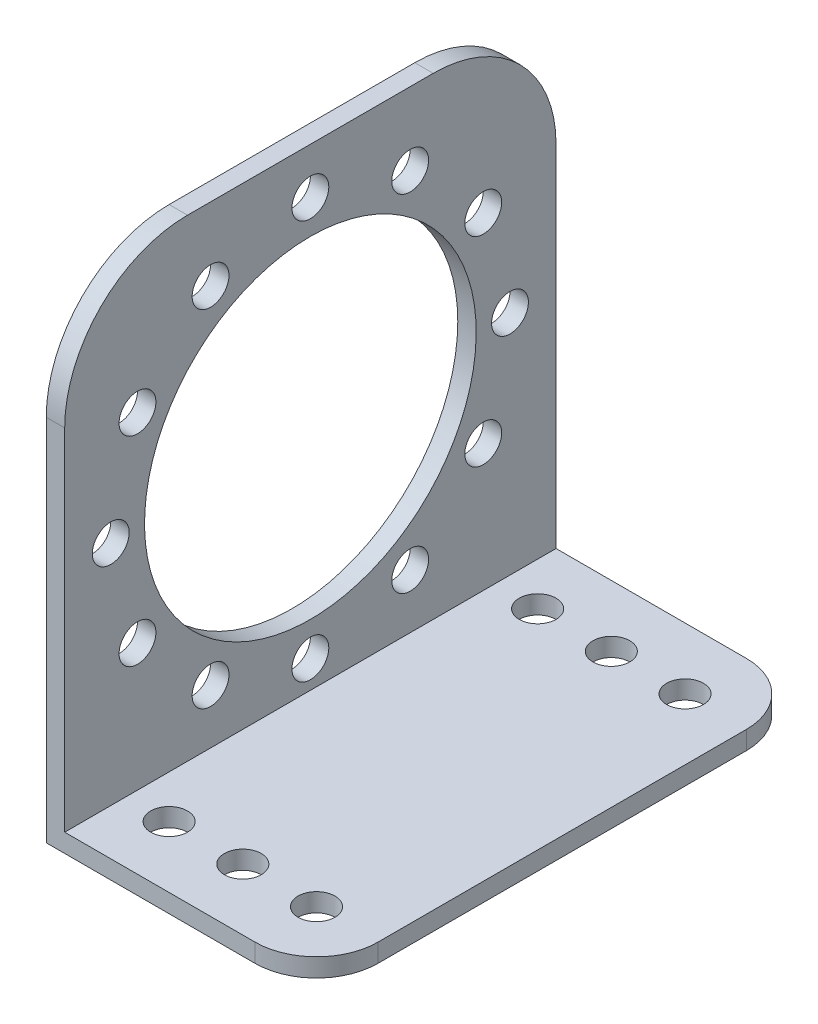
ISO-10303-21;
HEADER;
FILE_DESCRIPTION(('STEP AP214'),'2;1');
FILE_NAME('part.step','',(''),(''),'','','');
FILE_SCHEMA(('AUTOMOTIVE_DESIGN { 1 0 10303 214 1 1 1 1 }'));
ENDSEC;
DATA;
#1=APPLICATION_CONTEXT('core data for automotive mechanical design processes');
#2=APPLICATION_PROTOCOL_DEFINITION('international standard','automotive_design',2000,#1);
#3=PRODUCT_CONTEXT('',#1,'mechanical');
#4=PRODUCT('Part','Part','',(#3));
#5=PRODUCT_RELATED_PRODUCT_CATEGORY('part','',(#4));
#6=PRODUCT_DEFINITION_FORMATION('','',#4);
#7=PRODUCT_DEFINITION_CONTEXT('part definition',#1,'design');
#8=PRODUCT_DEFINITION('design','',#6,#7);
#9=PRODUCT_DEFINITION_SHAPE('','',#8);
#10=(LENGTH_UNIT() NAMED_UNIT(*) SI_UNIT(.MILLI.,.METRE.));
#11=(NAMED_UNIT(*) PLANE_ANGLE_UNIT() SI_UNIT($,.RADIAN.));
#12=(NAMED_UNIT(*) SI_UNIT($,.STERADIAN.) SOLID_ANGLE_UNIT());
#13=UNCERTAINTY_MEASURE_WITH_UNIT(LENGTH_MEASURE(1.E-05),#10,'distance_accuracy_value','');
#14=(GEOMETRIC_REPRESENTATION_CONTEXT(3) GLOBAL_UNCERTAINTY_ASSIGNED_CONTEXT((#13)) GLOBAL_UNIT_ASSIGNED_CONTEXT((#10,
#11,#12)) REPRESENTATION_CONTEXT('',''));
#15=CARTESIAN_POINT('',(0.,0.,0.));
#16=DIRECTION('',(0.,0.,1.));
#17=DIRECTION('',(1.,0.,0.));
#18=AXIS2_PLACEMENT_3D('',#15,#16,#17);
#19=CARTESIAN_POINT('',(0.,0.,20.));
#20=DIRECTION('',(1.,0.,0.));
#21=DIRECTION('',(0.,0.,-1.));
#22=AXIS2_PLACEMENT_3D('',#19,#20,#21);
#23=PLANE('',#22);
#24=CARTESIAN_POINT('',(0.,34.0729128114972,8.12499999999988));
#25=DIRECTION('',(1.,0.,0.));
#26=DIRECTION('',(0.,0.,-1.));
#27=AXIS2_PLACEMENT_3D('',#24,#25,#26);
#28=CIRCLE('',#27,1.5);
#29=CARTESIAN_POINT('',(0.,34.0729128114972,6.62499999999988));
#30=VERTEX_POINT('',#29);
#31=EDGE_CURVE('E211',#30,#30,#28,.T.);
#32=ORIENTED_EDGE('',*,*,#31,.T.);
#33=EDGE_LOOP('',(#32));
#34=FACE_BOUND('',#33,.T.);
#35=CARTESIAN_POINT('',(0.,28.1250000000001,14.0729128114971));
#36=DIRECTION('',(1.,0.,0.));
#37=DIRECTION('',(0.,0.,-1.));
#38=AXIS2_PLACEMENT_3D('',#35,#36,#37);
#39=CIRCLE('',#38,1.5);
#40=CARTESIAN_POINT('',(0.,28.1250000000001,12.5729128114971));
#41=VERTEX_POINT('',#40);
#42=EDGE_CURVE('E216',#41,#41,#39,.T.);
#43=ORIENTED_EDGE('',*,*,#42,.T.);
#44=EDGE_LOOP('',(#43));
#45=FACE_BOUND('',#44,.T.);
#46=CARTESIAN_POINT('',(0.,20.0000000000001,16.25));
#47=DIRECTION('',(1.,0.,0.));
#48=DIRECTION('',(0.,0.,-1.));
#49=AXIS2_PLACEMENT_3D('',#46,#47,#48);
#50=CIRCLE('',#49,1.5);
#51=CARTESIAN_POINT('',(0.,20.0000000000001,14.75));
#52=VERTEX_POINT('',#51);
#53=EDGE_CURVE('E219',#52,#52,#50,.T.);
#54=ORIENTED_EDGE('',*,*,#53,.T.);
#55=EDGE_LOOP('',(#54));
#56=FACE_BOUND('',#55,.T.);
#57=CARTESIAN_POINT('',(0.,11.8750000000001,14.0729128114972));
#58=DIRECTION('',(1.,0.,0.));
#59=DIRECTION('',(0.,0.,-1.));
#60=AXIS2_PLACEMENT_3D('',#57,#58,#59);
#61=CIRCLE('',#60,1.5);
#62=CARTESIAN_POINT('',(0.,11.8750000000001,12.5729128114972));
#63=VERTEX_POINT('',#62);
#64=EDGE_CURVE('E222',#63,#63,#61,.T.);
#65=ORIENTED_EDGE('',*,*,#64,.T.);
#66=EDGE_LOOP('',(#65));
#67=FACE_BOUND('',#66,.T.);
#68=CARTESIAN_POINT('',(0.,5.92708718850291,8.12500000000006));
#69=DIRECTION('',(1.,0.,0.));
#70=DIRECTION('',(0.,0.,-1.));
#71=AXIS2_PLACEMENT_3D('',#68,#69,#70);
#72=CIRCLE('',#71,1.5);
#73=CARTESIAN_POINT('',(0.,5.92708718850291,6.62500000000006));
#74=VERTEX_POINT('',#73);
#75=EDGE_CURVE('E225',#74,#74,#72,.T.);
#76=ORIENTED_EDGE('',*,*,#75,.T.);
#77=EDGE_LOOP('',(#76));
#78=FACE_BOUND('',#77,.T.);
#79=CARTESIAN_POINT('',(0.,3.75,0.));
#80=DIRECTION('',(1.,0.,0.));
#81=DIRECTION('',(0.,0.,-1.));
#82=AXIS2_PLACEMENT_3D('',#79,#80,#81);
#83=CIRCLE('',#82,1.5);
#84=CARTESIAN_POINT('',(0.,3.75,-1.49999999999994));
#85=VERTEX_POINT('',#84);
#86=EDGE_CURVE('E228',#85,#85,#83,.T.);
#87=ORIENTED_EDGE('',*,*,#86,.T.);
#88=EDGE_LOOP('',(#87));
#89=FACE_BOUND('',#88,.T.);
#90=CARTESIAN_POINT('',(0.,5.92708718850286,-8.12499999999997));
#91=DIRECTION('',(1.,0.,0.));
#92=DIRECTION('',(0.,0.,-1.));
#93=AXIS2_PLACEMENT_3D('',#90,#91,#92);
#94=CIRCLE('',#93,1.5);
#95=CARTESIAN_POINT('',(0.,5.92708718850286,-9.62499999999997));
#96=VERTEX_POINT('',#95);
#97=EDGE_CURVE('E231',#96,#96,#94,.T.);
#98=ORIENTED_EDGE('',*,*,#97,.T.);
#99=EDGE_LOOP('',(#98));
#100=FACE_BOUND('',#99,.T.);
#101=CARTESIAN_POINT('',(0.,11.875,-14.0729128114971));
#102=DIRECTION('',(1.,0.,0.));
#103=DIRECTION('',(0.,0.,-1.));
#104=AXIS2_PLACEMENT_3D('',#101,#102,#103);
#105=CIRCLE('',#104,1.5);
#106=CARTESIAN_POINT('',(0.,11.875,-15.5729128114971));
#107=VERTEX_POINT('',#106);
#108=EDGE_CURVE('E234',#107,#107,#105,.T.);
#109=ORIENTED_EDGE('',*,*,#108,.T.);
#110=EDGE_LOOP('',(#109));
#111=FACE_BOUND('',#110,.T.);
#112=CARTESIAN_POINT('',(0.,36.25,-1.73472347597681E-13));
#113=DIRECTION('',(1.,0.,0.));
#114=DIRECTION('',(0.,0.,-1.));
#115=AXIS2_PLACEMENT_3D('',#112,#113,#114);
#116=CIRCLE('',#115,1.5);
#117=CARTESIAN_POINT('',(0.,36.25,-1.50000000000017));
#118=VERTEX_POINT('',#117);
#119=EDGE_CURVE('E237',#118,#118,#116,.T.);
#120=ORIENTED_EDGE('',*,*,#119,.T.);
#121=EDGE_LOOP('',(#120));
#122=FACE_BOUND('',#121,.T.);
#123=CARTESIAN_POINT('',(0.,34.072912811497,-8.12500000000017));
#124=DIRECTION('',(1.,0.,0.));
#125=DIRECTION('',(0.,0.,-1.));
#126=AXIS2_PLACEMENT_3D('',#123,#124,#125);
#127=CIRCLE('',#126,1.5);
#128=CARTESIAN_POINT('',(0.,34.072912811497,-9.62500000000017));
#129=VERTEX_POINT('',#128);
#130=EDGE_CURVE('E240',#129,#129,#127,.T.);
#131=ORIENTED_EDGE('',*,*,#130,.T.);
#132=EDGE_LOOP('',(#131));
#133=FACE_BOUND('',#132,.T.);
#134=CARTESIAN_POINT('',(0.,28.1249999999998,-14.0729128114972));
#135=DIRECTION('',(1.,0.,0.));
#136=DIRECTION('',(0.,0.,-1.));
#137=AXIS2_PLACEMENT_3D('',#134,#135,#136);
#138=CIRCLE('',#137,1.5);
#139=CARTESIAN_POINT('',(0.,28.1249999999998,-15.5729128114972));
#140=VERTEX_POINT('',#139);
#141=EDGE_CURVE('E243',#140,#140,#138,.T.);
#142=ORIENTED_EDGE('',*,*,#141,.T.);
#143=EDGE_LOOP('',(#142));
#144=FACE_BOUND('',#143,.T.);
#145=CARTESIAN_POINT('',(0.,20.,-16.25));
#146=DIRECTION('',(1.,0.,0.));
#147=DIRECTION('',(0.,0.,-1.));
#148=AXIS2_PLACEMENT_3D('',#145,#146,#147);
#149=CIRCLE('',#148,1.5);
#150=CARTESIAN_POINT('',(0.,20.,-17.75));
#151=VERTEX_POINT('',#150);
#152=EDGE_CURVE('E246',#151,#151,#149,.T.);
#153=ORIENTED_EDGE('',*,*,#152,.T.);
#154=EDGE_LOOP('',(#153));
#155=FACE_BOUND('',#154,.T.);
#156=CARTESIAN_POINT('',(0.,20.,0.));
#157=DIRECTION('',(1.,0.,0.));
#158=DIRECTION('',(0.,0.,-1.));
#159=AXIS2_PLACEMENT_3D('',#156,#157,#158);
#160=CIRCLE('',#159,13.5);
#161=CARTESIAN_POINT('',(0.,20.,-13.5));
#162=VERTEX_POINT('',#161);
#163=EDGE_CURVE('E204',#162,#162,#160,.T.);
#164=ORIENTED_EDGE('',*,*,#163,.T.);
#165=EDGE_LOOP('',(#164));
#166=FACE_BOUND('',#165,.T.);
#167=DIRECTION('',(0.,0.,-1.));
#168=VECTOR('',#167,1.);
#169=CARTESIAN_POINT('',(0.,40.,20.));
#170=LINE('',#169,#168);
#171=CARTESIAN_POINT('',(0.,40.,10.));
#172=VERTEX_POINT('',#171);
#173=CARTESIAN_POINT('',(0.,40.,-10.));
#174=VERTEX_POINT('',#173);
#175=EDGE_CURVE('E190',#172,#174,#170,.T.);
#176=ORIENTED_EDGE('',*,*,#175,.T.);
#177=CARTESIAN_POINT('',(0.,30.,-10.));
#178=DIRECTION('',(1.,0.,0.));
#179=DIRECTION('',(0.,0.,-1.));
#180=AXIS2_PLACEMENT_3D('',#177,#178,#179);
#181=CIRCLE('',#180,10.);
#182=CARTESIAN_POINT('',(0.,30.,-20.));
#183=VERTEX_POINT('',#182);
#184=EDGE_CURVE('E148',#174,#183,#181,.F.);
#185=ORIENTED_EDGE('',*,*,#184,.T.);
#186=DIRECTION('',(0.,-1.,0.));
#187=VECTOR('',#186,1.);
#188=CARTESIAN_POINT('',(0.,0.,-20.));
#189=LINE('',#188,#187);
#190=CARTESIAN_POINT('',(0.,0.,-20.));
#191=VERTEX_POINT('',#190);
#192=EDGE_CURVE('E133',#183,#191,#189,.T.);
#193=ORIENTED_EDGE('',*,*,#192,.T.);
#194=DIRECTION('',(0.,0.,-1.));
#195=VECTOR('',#194,1.);
#196=CARTESIAN_POINT('',(0.,0.,20.));
#197=LINE('',#196,#195);
#198=CARTESIAN_POINT('',(0.,0.,20.));
#199=VERTEX_POINT('',#198);
#200=EDGE_CURVE('E128',#199,#191,#197,.T.);
#201=ORIENTED_EDGE('',*,*,#200,.F.);
#202=DIRECTION('',(0.,-1.,0.));
#203=VECTOR('',#202,1.);
#204=CARTESIAN_POINT('',(0.,0.,20.));
#205=LINE('',#204,#203);
#206=CARTESIAN_POINT('',(0.,30.,20.));
#207=VERTEX_POINT('',#206);
#208=EDGE_CURVE('E115',#207,#199,#205,.T.);
#209=ORIENTED_EDGE('',*,*,#208,.F.);
#210=CARTESIAN_POINT('',(0.,30.,10.));
#211=DIRECTION('',(1.,0.,0.));
#212=DIRECTION('',(0.,0.,-1.));
#213=AXIS2_PLACEMENT_3D('',#210,#211,#212);
#214=CIRCLE('',#213,10.);
#215=EDGE_CURVE('E146',#207,#172,#214,.F.);
#216=ORIENTED_EDGE('',*,*,#215,.T.);
#217=EDGE_LOOP('',(#176,#185,#193,#201,#209,#216));
#218=FACE_BOUND('',#217,.T.);
#219=ADVANCED_FACE('F34',(#34,#45,#56,#67,#78,#89,#100,#111,#122,#133,#144,#155,#166,#218),#23,.F.);
#220=CARTESIAN_POINT('',(0.,0.,20.));
#221=DIRECTION('',(0.,1.,0.));
#222=DIRECTION('',(0.,0.,1.));
#223=AXIS2_PLACEMENT_3D('',#220,#221,#222);
#224=PLANE('',#223);
#225=CARTESIAN_POINT('',(5.,0.,15.));
#226=DIRECTION('',(0.,1.,0.));
#227=DIRECTION('',(0.,0.,1.));
#228=AXIS2_PLACEMENT_3D('',#225,#226,#227);
#229=CIRCLE('',#228,1.5);
#230=CARTESIAN_POINT('',(5.,0.,16.5));
#231=VERTEX_POINT('',#230);
#232=EDGE_CURVE('E281',#231,#231,#229,.T.);
#233=ORIENTED_EDGE('',*,*,#232,.T.);
#234=EDGE_LOOP('',(#233));
#235=FACE_BOUND('',#234,.T.);
#236=CARTESIAN_POINT('',(11.,0.,15.));
#237=DIRECTION('',(0.,1.,0.));
#238=DIRECTION('',(0.,0.,1.));
#239=AXIS2_PLACEMENT_3D('',#236,#237,#238);
#240=CIRCLE('',#239,1.5);
#241=CARTESIAN_POINT('',(11.,0.,16.5));
#242=VERTEX_POINT('',#241);
#243=EDGE_CURVE('E288',#242,#242,#240,.T.);
#244=ORIENTED_EDGE('',*,*,#243,.T.);
#245=EDGE_LOOP('',(#244));
#246=FACE_BOUND('',#245,.T.);
#247=CARTESIAN_POINT('',(17.,0.,15.));
#248=DIRECTION('',(0.,1.,0.));
#249=DIRECTION('',(0.,0.,1.));
#250=AXIS2_PLACEMENT_3D('',#247,#248,#249);
#251=CIRCLE('',#250,1.5);
#252=CARTESIAN_POINT('',(17.,0.,16.5));
#253=VERTEX_POINT('',#252);
#254=EDGE_CURVE('E291',#253,#253,#251,.T.);
#255=ORIENTED_EDGE('',*,*,#254,.T.);
#256=EDGE_LOOP('',(#255));
#257=FACE_BOUND('',#256,.T.);
#258=CARTESIAN_POINT('',(17.,0.,-15.));
#259=DIRECTION('',(0.,1.,0.));
#260=DIRECTION('',(0.,0.,1.));
#261=AXIS2_PLACEMENT_3D('',#258,#259,#260);
#262=CIRCLE('',#261,1.5);
#263=CARTESIAN_POINT('',(17.,0.,-13.5));
#264=VERTEX_POINT('',#263);
#265=EDGE_CURVE('E294',#264,#264,#262,.T.);
#266=ORIENTED_EDGE('',*,*,#265,.T.);
#267=EDGE_LOOP('',(#266));
#268=FACE_BOUND('',#267,.T.);
#269=CARTESIAN_POINT('',(11.,0.,-15.));
#270=DIRECTION('',(0.,1.,0.));
#271=DIRECTION('',(0.,0.,1.));
#272=AXIS2_PLACEMENT_3D('',#269,#270,#271);
#273=CIRCLE('',#272,1.5);
#274=CARTESIAN_POINT('',(11.,0.,-13.5));
#275=VERTEX_POINT('',#274);
#276=EDGE_CURVE('E297',#275,#275,#273,.T.);
#277=ORIENTED_EDGE('',*,*,#276,.T.);
#278=EDGE_LOOP('',(#277));
#279=FACE_BOUND('',#278,.T.);
#280=CARTESIAN_POINT('',(5.,0.,-15.));
#281=DIRECTION('',(0.,1.,0.));
#282=DIRECTION('',(0.,0.,1.));
#283=AXIS2_PLACEMENT_3D('',#280,#281,#282);
#284=CIRCLE('',#283,1.5);
#285=CARTESIAN_POINT('',(5.,0.,-13.5));
#286=VERTEX_POINT('',#285);
#287=EDGE_CURVE('E300',#286,#286,#284,.T.);
#288=ORIENTED_EDGE('',*,*,#287,.T.);
#289=EDGE_LOOP('',(#288));
#290=FACE_BOUND('',#289,.T.);
#291=DIRECTION('',(1.,0.,0.));
#292=VECTOR('',#291,1.);
#293=CARTESIAN_POINT('',(0.,0.,-20.));
#294=LINE('',#293,#292);
#295=CARTESIAN_POINT('',(17.,0.,-20.));
#296=VERTEX_POINT('',#295);
#297=EDGE_CURVE('E168',#191,#296,#294,.T.);
#298=ORIENTED_EDGE('',*,*,#297,.T.);
#299=CARTESIAN_POINT('',(17.,0.,-15.));
#300=DIRECTION('',(0.,1.,0.));
#301=DIRECTION('',(0.,0.,1.));
#302=AXIS2_PLACEMENT_3D('',#299,#300,#301);
#303=CIRCLE('',#302,5.);
#304=CARTESIAN_POINT('',(22.,0.,-15.));
#305=VERTEX_POINT('',#304);
#306=EDGE_CURVE('E42',#296,#305,#303,.F.);
#307=ORIENTED_EDGE('',*,*,#306,.T.);
#308=DIRECTION('',(0.,0.,-1.));
#309=VECTOR('',#308,1.);
#310=CARTESIAN_POINT('',(22.,0.,20.));
#311=LINE('',#310,#309);
#312=CARTESIAN_POINT('',(22.,0.,15.));
#313=VERTEX_POINT('',#312);
#314=EDGE_CURVE('E135',#313,#305,#311,.T.);
#315=ORIENTED_EDGE('',*,*,#314,.F.);
#316=CARTESIAN_POINT('',(17.,0.,15.));
#317=DIRECTION('',(0.,1.,0.));
#318=DIRECTION('',(0.,0.,1.));
#319=AXIS2_PLACEMENT_3D('',#316,#317,#318);
#320=CIRCLE('',#319,5.);
#321=CARTESIAN_POINT('',(17.,0.,20.));
#322=VERTEX_POINT('',#321);
#323=EDGE_CURVE('E49',#313,#322,#320,.F.);
#324=ORIENTED_EDGE('',*,*,#323,.T.);
#325=DIRECTION('',(1.,0.,0.));
#326=VECTOR('',#325,1.);
#327=CARTESIAN_POINT('',(0.,0.,20.));
#328=LINE('',#327,#326);
#329=EDGE_CURVE('E117',#199,#322,#328,.T.);
#330=ORIENTED_EDGE('',*,*,#329,.F.);
#331=ORIENTED_EDGE('',*,*,#200,.T.);
#332=EDGE_LOOP('',(#298,#307,#315,#324,#330,#331));
#333=FACE_BOUND('',#332,.T.);
#334=ADVANCED_FACE('F127',(#235,#246,#257,#268,#279,#290,#333),#224,.F.);
#335=CARTESIAN_POINT('',(22.,1.5,20.));
#336=DIRECTION('',(-1.,0.,0.));
#337=DIRECTION('',(0.,0.,1.));
#338=AXIS2_PLACEMENT_3D('',#335,#336,#337);
#339=PLANE('',#338);
#340=ORIENTED_EDGE('',*,*,#314,.T.);
#341=DIRECTION('',(0.,1.,0.));
#342=VECTOR('',#341,1.);
#343=CARTESIAN_POINT('',(22.,1.5,-15.));
#344=LINE('',#343,#342);
#345=CARTESIAN_POINT('',(22.,1.5,-15.));
#346=VERTEX_POINT('',#345);
#347=EDGE_CURVE('E159',#305,#346,#344,.T.);
#348=ORIENTED_EDGE('',*,*,#347,.T.);
#349=DIRECTION('',(0.,0.,-1.));
#350=VECTOR('',#349,1.);
#351=CARTESIAN_POINT('',(22.,1.5,20.));
#352=LINE('',#351,#350);
#353=CARTESIAN_POINT('',(22.,1.5,15.));
#354=VERTEX_POINT('',#353);
#355=EDGE_CURVE('E140',#354,#346,#352,.T.);
#356=ORIENTED_EDGE('',*,*,#355,.F.);
#357=DIRECTION('',(0.,1.,0.));
#358=VECTOR('',#357,1.);
#359=CARTESIAN_POINT('',(22.,1.5,15.));
#360=LINE('',#359,#358);
#361=EDGE_CURVE('E157',#354,#313,#360,.F.);
#362=ORIENTED_EDGE('',*,*,#361,.T.);
#363=EDGE_LOOP('',(#340,#348,#356,#362));
#364=FACE_BOUND('',#363,.T.);
#365=ADVANCED_FACE('F172',(#364),#339,.F.);
#366=CARTESIAN_POINT('',(1.5,1.5,20.));
#367=DIRECTION('',(0.,-1.,0.));
#368=DIRECTION('',(0.,0.,-1.));
#369=AXIS2_PLACEMENT_3D('',#366,#367,#368);
#370=PLANE('',#369);
#371=CARTESIAN_POINT('',(5.,1.5,15.));
#372=DIRECTION('',(0.,1.,0.));
#373=DIRECTION('',(0.,0.,-1.));
#374=AXIS2_PLACEMENT_3D('',#371,#372,#373);
#375=CIRCLE('',#374,1.5);
#376=CARTESIAN_POINT('',(5.,1.5,13.5));
#377=VERTEX_POINT('',#376);
#378=EDGE_CURVE('E307',#377,#377,#375,.T.);
#379=ORIENTED_EDGE('',*,*,#378,.F.);
#380=EDGE_LOOP('',(#379));
#381=FACE_BOUND('',#380,.T.);
#382=CARTESIAN_POINT('',(11.,1.5,15.));
#383=DIRECTION('',(0.,1.,0.));
#384=DIRECTION('',(0.,0.,-1.));
#385=AXIS2_PLACEMENT_3D('',#382,#383,#384);
#386=CIRCLE('',#385,1.5);
#387=CARTESIAN_POINT('',(11.,1.5,13.5));
#388=VERTEX_POINT('',#387);
#389=EDGE_CURVE('E310',#388,#388,#386,.T.);
#390=ORIENTED_EDGE('',*,*,#389,.F.);
#391=EDGE_LOOP('',(#390));
#392=FACE_BOUND('',#391,.T.);
#393=CARTESIAN_POINT('',(17.,1.5,15.));
#394=DIRECTION('',(0.,1.,0.));
#395=DIRECTION('',(0.,0.,-1.));
#396=AXIS2_PLACEMENT_3D('',#393,#394,#395);
#397=CIRCLE('',#396,1.5);
#398=CARTESIAN_POINT('',(17.,1.5,13.5));
#399=VERTEX_POINT('',#398);
#400=EDGE_CURVE('E313',#399,#399,#397,.T.);
#401=ORIENTED_EDGE('',*,*,#400,.F.);
#402=EDGE_LOOP('',(#401));
#403=FACE_BOUND('',#402,.T.);
#404=CARTESIAN_POINT('',(17.,1.5,-15.));
#405=DIRECTION('',(0.,1.,0.));
#406=DIRECTION('',(0.,0.,1.));
#407=AXIS2_PLACEMENT_3D('',#404,#405,#406);
#408=CIRCLE('',#407,1.5);
#409=CARTESIAN_POINT('',(17.,1.5,-13.5));
#410=VERTEX_POINT('',#409);
#411=EDGE_CURVE('E316',#410,#410,#408,.T.);
#412=ORIENTED_EDGE('',*,*,#411,.F.);
#413=EDGE_LOOP('',(#412));
#414=FACE_BOUND('',#413,.T.);
#415=CARTESIAN_POINT('',(11.,1.5,-15.));
#416=DIRECTION('',(0.,1.,0.));
#417=DIRECTION('',(0.,0.,1.));
#418=AXIS2_PLACEMENT_3D('',#415,#416,#417);
#419=CIRCLE('',#418,1.5);
#420=CARTESIAN_POINT('',(11.,1.5,-13.5));
#421=VERTEX_POINT('',#420);
#422=EDGE_CURVE('E306',#421,#421,#419,.T.);
#423=ORIENTED_EDGE('',*,*,#422,.F.);
#424=EDGE_LOOP('',(#423));
#425=FACE_BOUND('',#424,.T.);
#426=CARTESIAN_POINT('',(5.,1.5,-15.));
#427=DIRECTION('',(0.,1.,0.));
#428=DIRECTION('',(0.,0.,1.));
#429=AXIS2_PLACEMENT_3D('',#426,#427,#428);
#430=CIRCLE('',#429,1.5);
#431=CARTESIAN_POINT('',(5.,1.5,-13.5));
#432=VERTEX_POINT('',#431);
#433=EDGE_CURVE('E303',#432,#432,#430,.T.);
#434=ORIENTED_EDGE('',*,*,#433,.F.);
#435=EDGE_LOOP('',(#434));
#436=FACE_BOUND('',#435,.T.);
#437=ORIENTED_EDGE('',*,*,#355,.T.);
#438=CARTESIAN_POINT('',(17.,1.5,-15.));
#439=DIRECTION('',(0.,-1.,0.));
#440=DIRECTION('',(0.,0.,-1.));
#441=AXIS2_PLACEMENT_3D('',#438,#439,#440);
#442=CIRCLE('',#441,5.);
#443=CARTESIAN_POINT('',(17.,1.5,-20.));
#444=VERTEX_POINT('',#443);
#445=EDGE_CURVE('E164',#346,#444,#442,.F.);
#446=ORIENTED_EDGE('',*,*,#445,.T.);
#447=DIRECTION('',(-1.,0.,0.));
#448=VECTOR('',#447,1.);
#449=CARTESIAN_POINT('',(1.5,1.5,-20.));
#450=LINE('',#449,#448);
#451=CARTESIAN_POINT('',(1.5,1.5,-20.));
#452=VERTEX_POINT('',#451);
#453=EDGE_CURVE('E180',#444,#452,#450,.T.);
#454=ORIENTED_EDGE('',*,*,#453,.T.);
#455=DIRECTION('',(0.,0.,-1.));
#456=VECTOR('',#455,1.);
#457=CARTESIAN_POINT('',(1.5,1.5,20.));
#458=LINE('',#457,#456);
#459=CARTESIAN_POINT('',(1.5,1.5,20.));
#460=VERTEX_POINT('',#459);
#461=EDGE_CURVE('E196',#460,#452,#458,.T.);
#462=ORIENTED_EDGE('',*,*,#461,.F.);
#463=DIRECTION('',(-1.,0.,0.));
#464=VECTOR('',#463,1.);
#465=CARTESIAN_POINT('',(1.5,1.5,20.));
#466=LINE('',#465,#464);
#467=CARTESIAN_POINT('',(17.,1.5,20.));
#468=VERTEX_POINT('',#467);
#469=EDGE_CURVE('E129',#468,#460,#466,.T.);
#470=ORIENTED_EDGE('',*,*,#469,.F.);
#471=CARTESIAN_POINT('',(17.,1.5,15.));
#472=DIRECTION('',(0.,-1.,0.));
#473=DIRECTION('',(0.,0.,-1.));
#474=AXIS2_PLACEMENT_3D('',#471,#472,#473);
#475=CIRCLE('',#474,5.);
#476=EDGE_CURVE('E162',#468,#354,#475,.F.);
#477=ORIENTED_EDGE('',*,*,#476,.T.);
#478=EDGE_LOOP('',(#437,#446,#454,#462,#470,#477));
#479=FACE_BOUND('',#478,.T.);
#480=ADVANCED_FACE('F178',(#381,#392,#403,#414,#425,#436,#479),#370,.F.);
#481=CARTESIAN_POINT('',(1.5,40.,20.));
#482=DIRECTION('',(-1.,0.,0.));
#483=DIRECTION('',(0.,-1.,0.));
#484=AXIS2_PLACEMENT_3D('',#481,#482,#483);
#485=PLANE('',#484);
#486=CARTESIAN_POINT('',(1.5,34.0729128114972,8.12499999999988));
#487=DIRECTION('',(1.,0.,0.));
#488=DIRECTION('',(0.,1.,0.));
#489=AXIS2_PLACEMENT_3D('',#486,#487,#488);
#490=CIRCLE('',#489,1.5);
#491=CARTESIAN_POINT('',(1.5,35.5729128114972,8.12499999999988));
#492=VERTEX_POINT('',#491);
#493=EDGE_CURVE('E265',#492,#492,#490,.T.);
#494=ORIENTED_EDGE('',*,*,#493,.F.);
#495=EDGE_LOOP('',(#494));
#496=FACE_BOUND('',#495,.T.);
#497=CARTESIAN_POINT('',(1.5,28.1250000000001,14.0729128114971));
#498=DIRECTION('',(1.,0.,0.));
#499=DIRECTION('',(0.,1.,0.));
#500=AXIS2_PLACEMENT_3D('',#497,#498,#499);
#501=CIRCLE('',#500,1.5);
#502=CARTESIAN_POINT('',(1.5,29.6250000000001,14.0729128114971));
#503=VERTEX_POINT('',#502);
#504=EDGE_CURVE('E268',#503,#503,#501,.T.);
#505=ORIENTED_EDGE('',*,*,#504,.F.);
#506=EDGE_LOOP('',(#505));
#507=FACE_BOUND('',#506,.T.);
#508=CARTESIAN_POINT('',(1.5,20.0000000000001,16.25));
#509=DIRECTION('',(1.,0.,0.));
#510=DIRECTION('',(0.,1.,0.));
#511=AXIS2_PLACEMENT_3D('',#508,#509,#510);
#512=CIRCLE('',#511,1.5);
#513=CARTESIAN_POINT('',(1.5,21.5000000000001,16.25));
#514=VERTEX_POINT('',#513);
#515=EDGE_CURVE('E272',#514,#514,#512,.T.);
#516=ORIENTED_EDGE('',*,*,#515,.F.);
#517=EDGE_LOOP('',(#516));
#518=FACE_BOUND('',#517,.T.);
#519=CARTESIAN_POINT('',(1.5,11.8750000000001,14.0729128114972));
#520=DIRECTION('',(1.,0.,0.));
#521=DIRECTION('',(0.,1.,0.));
#522=AXIS2_PLACEMENT_3D('',#519,#520,#521);
#523=CIRCLE('',#522,1.5);
#524=CARTESIAN_POINT('',(1.5,13.3750000000001,14.0729128114972));
#525=VERTEX_POINT('',#524);
#526=EDGE_CURVE('E257',#525,#525,#523,.T.);
#527=ORIENTED_EDGE('',*,*,#526,.F.);
#528=EDGE_LOOP('',(#527));
#529=FACE_BOUND('',#528,.T.);
#530=CARTESIAN_POINT('',(1.5,5.92708718850291,8.12500000000006));
#531=DIRECTION('',(1.,0.,0.));
#532=DIRECTION('',(0.,1.,0.));
#533=AXIS2_PLACEMENT_3D('',#530,#531,#532);
#534=CIRCLE('',#533,1.5);
#535=CARTESIAN_POINT('',(1.5,7.42708718850291,8.12500000000006));
#536=VERTEX_POINT('',#535);
#537=EDGE_CURVE('E253',#536,#536,#534,.T.);
#538=ORIENTED_EDGE('',*,*,#537,.F.);
#539=EDGE_LOOP('',(#538));
#540=FACE_BOUND('',#539,.T.);
#541=CARTESIAN_POINT('',(1.5,3.75,0.));
#542=DIRECTION('',(1.,0.,0.));
#543=DIRECTION('',(0.,1.,0.));
#544=AXIS2_PLACEMENT_3D('',#541,#542,#543);
#545=CIRCLE('',#544,1.5);
#546=CARTESIAN_POINT('',(1.5,5.25,0.));
#547=VERTEX_POINT('',#546);
#548=EDGE_CURVE('E256',#547,#547,#545,.T.);
#549=ORIENTED_EDGE('',*,*,#548,.F.);
#550=EDGE_LOOP('',(#549));
#551=FACE_BOUND('',#550,.T.);
#552=CARTESIAN_POINT('',(1.5,5.92708718850286,-8.12499999999997));
#553=DIRECTION('',(1.,0.,0.));
#554=DIRECTION('',(0.,1.,0.));
#555=AXIS2_PLACEMENT_3D('',#552,#553,#554);
#556=CIRCLE('',#555,1.5);
#557=CARTESIAN_POINT('',(1.5,7.42708718850286,-8.12499999999997));
#558=VERTEX_POINT('',#557);
#559=EDGE_CURVE('E260',#558,#558,#556,.T.);
#560=ORIENTED_EDGE('',*,*,#559,.F.);
#561=EDGE_LOOP('',(#560));
#562=FACE_BOUND('',#561,.T.);
#563=CARTESIAN_POINT('',(1.5,11.875,-14.0729128114971));
#564=DIRECTION('',(1.,0.,0.));
#565=DIRECTION('',(0.,1.,0.));
#566=AXIS2_PLACEMENT_3D('',#563,#564,#565);
#567=CIRCLE('',#566,1.5);
#568=CARTESIAN_POINT('',(1.5,13.375,-14.0729128114971));
#569=VERTEX_POINT('',#568);
#570=EDGE_CURVE('E252',#569,#569,#567,.T.);
#571=ORIENTED_EDGE('',*,*,#570,.F.);
#572=EDGE_LOOP('',(#571));
#573=FACE_BOUND('',#572,.T.);
#574=CARTESIAN_POINT('',(1.5,36.25,-1.73472347597681E-13));
#575=DIRECTION('',(1.,0.,0.));
#576=DIRECTION('',(0.,1.,0.));
#577=AXIS2_PLACEMENT_3D('',#574,#575,#576);
#578=CIRCLE('',#577,1.5);
#579=CARTESIAN_POINT('',(1.5,37.75,-1.73472347597681E-13));
#580=VERTEX_POINT('',#579);
#581=EDGE_CURVE('E269',#580,#580,#578,.T.);
#582=ORIENTED_EDGE('',*,*,#581,.F.);
#583=EDGE_LOOP('',(#582));
#584=FACE_BOUND('',#583,.T.);
#585=CARTESIAN_POINT('',(1.5,34.072912811497,-8.12500000000017));
#586=DIRECTION('',(1.,0.,0.));
#587=DIRECTION('',(0.,1.,0.));
#588=AXIS2_PLACEMENT_3D('',#585,#586,#587);
#589=CIRCLE('',#588,1.5);
#590=CARTESIAN_POINT('',(1.5,35.572912811497,-8.12500000000017));
#591=VERTEX_POINT('',#590);
#592=EDGE_CURVE('E280',#591,#591,#589,.T.);
#593=ORIENTED_EDGE('',*,*,#592,.F.);
#594=EDGE_LOOP('',(#593));
#595=FACE_BOUND('',#594,.T.);
#596=CARTESIAN_POINT('',(1.5,28.1249999999998,-14.0729128114972));
#597=DIRECTION('',(1.,0.,0.));
#598=DIRECTION('',(0.,1.,0.));
#599=AXIS2_PLACEMENT_3D('',#596,#597,#598);
#600=CIRCLE('',#599,1.5);
#601=CARTESIAN_POINT('',(1.5,29.6249999999998,-14.0729128114972));
#602=VERTEX_POINT('',#601);
#603=EDGE_CURVE('E277',#602,#602,#600,.T.);
#604=ORIENTED_EDGE('',*,*,#603,.F.);
#605=EDGE_LOOP('',(#604));
#606=FACE_BOUND('',#605,.T.);
#607=CARTESIAN_POINT('',(1.5,20.,-16.25));
#608=DIRECTION('',(1.,0.,0.));
#609=DIRECTION('',(0.,1.,0.));
#610=AXIS2_PLACEMENT_3D('',#607,#608,#609);
#611=CIRCLE('',#610,1.5);
#612=CARTESIAN_POINT('',(1.5,21.5,-16.25));
#613=VERTEX_POINT('',#612);
#614=EDGE_CURVE('E249',#613,#613,#611,.T.);
#615=ORIENTED_EDGE('',*,*,#614,.F.);
#616=EDGE_LOOP('',(#615));
#617=FACE_BOUND('',#616,.T.);
#618=CARTESIAN_POINT('',(1.5,20.,0.));
#619=DIRECTION('',(1.,0.,0.));
#620=DIRECTION('',(0.,1.,0.));
#621=AXIS2_PLACEMENT_3D('',#618,#619,#620);
#622=CIRCLE('',#621,13.5);
#623=CARTESIAN_POINT('',(1.5,33.5,0.));
#624=VERTEX_POINT('',#623);
#625=EDGE_CURVE('E206',#624,#624,#622,.T.);
#626=ORIENTED_EDGE('',*,*,#625,.F.);
#627=EDGE_LOOP('',(#626));
#628=FACE_BOUND('',#627,.T.);
#629=DIRECTION('',(0.,1.,0.));
#630=VECTOR('',#629,1.);
#631=CARTESIAN_POINT('',(1.5,40.,-20.));
#632=LINE('',#631,#630);
#633=CARTESIAN_POINT('',(1.5,30.,-20.));
#634=VERTEX_POINT('',#633);
#635=EDGE_CURVE('E124',#452,#634,#632,.T.);
#636=ORIENTED_EDGE('',*,*,#635,.T.);
#637=CARTESIAN_POINT('',(1.5,30.,-10.));
#638=DIRECTION('',(-1.,0.,0.));
#639=DIRECTION('',(0.,-1.,0.));
#640=AXIS2_PLACEMENT_3D('',#637,#638,#639);
#641=CIRCLE('',#640,10.);
#642=CARTESIAN_POINT('',(1.5,40.,-10.));
#643=VERTEX_POINT('',#642);
#644=EDGE_CURVE('E154',#634,#643,#641,.F.);
#645=ORIENTED_EDGE('',*,*,#644,.T.);
#646=DIRECTION('',(0.,0.,-1.));
#647=VECTOR('',#646,1.);
#648=CARTESIAN_POINT('',(1.5,40.,20.));
#649=LINE('',#648,#647);
#650=CARTESIAN_POINT('',(1.5,40.,10.));
#651=VERTEX_POINT('',#650);
#652=EDGE_CURVE('E192',#651,#643,#649,.T.);
#653=ORIENTED_EDGE('',*,*,#652,.F.);
#654=CARTESIAN_POINT('',(1.5,30.,10.));
#655=DIRECTION('',(-1.,0.,0.));
#656=DIRECTION('',(0.,-1.,0.));
#657=AXIS2_PLACEMENT_3D('',#654,#655,#656);
#658=CIRCLE('',#657,10.);
#659=CARTESIAN_POINT('',(1.5,30.,20.));
#660=VERTEX_POINT('',#659);
#661=EDGE_CURVE('E152',#651,#660,#658,.F.);
#662=ORIENTED_EDGE('',*,*,#661,.T.);
#663=DIRECTION('',(0.,1.,0.));
#664=VECTOR('',#663,1.);
#665=CARTESIAN_POINT('',(1.5,40.,20.));
#666=LINE('',#665,#664);
#667=EDGE_CURVE('E193',#460,#660,#666,.T.);
#668=ORIENTED_EDGE('',*,*,#667,.F.);
#669=ORIENTED_EDGE('',*,*,#461,.T.);
#670=EDGE_LOOP('',(#636,#645,#653,#662,#668,#669));
#671=FACE_BOUND('',#670,.T.);
#672=ADVANCED_FACE('F199',(#496,#507,#518,#529,#540,#551,#562,#573,#584,#595,#606,#617,#628,
#671),#485,.F.);
#673=CARTESIAN_POINT('',(0.,40.,20.));
#674=DIRECTION('',(0.,-1.,0.));
#675=DIRECTION('',(0.,0.,-1.));
#676=AXIS2_PLACEMENT_3D('',#673,#674,#675);
#677=PLANE('',#676);
#678=ORIENTED_EDGE('',*,*,#652,.T.);
#679=DIRECTION('',(-1.,0.,0.));
#680=VECTOR('',#679,1.);
#681=CARTESIAN_POINT('',(0.,40.,-10.));
#682=LINE('',#681,#680);
#683=EDGE_CURVE('E137',#643,#174,#682,.T.);
#684=ORIENTED_EDGE('',*,*,#683,.T.);
#685=ORIENTED_EDGE('',*,*,#175,.F.);
#686=DIRECTION('',(-1.,0.,0.));
#687=VECTOR('',#686,1.);
#688=CARTESIAN_POINT('',(0.,40.,10.));
#689=LINE('',#688,#687);
#690=EDGE_CURVE('E134',#172,#651,#689,.F.);
#691=ORIENTED_EDGE('',*,*,#690,.T.);
#692=EDGE_LOOP('',(#678,#684,#685,#691));
#693=FACE_BOUND('',#692,.T.);
#694=ADVANCED_FACE('F390',(#693),#677,.F.);
#695=CARTESIAN_POINT('',(0.,0.,20.));
#696=DIRECTION('',(0.,0.,-1.));
#697=DIRECTION('',(-1.,0.,0.));
#698=AXIS2_PLACEMENT_3D('',#695,#696,#697);
#699=PLANE('',#698);
#700=ORIENTED_EDGE('',*,*,#329,.T.);
#701=DIRECTION('',(0.,1.,0.));
#702=VECTOR('',#701,1.);
#703=CARTESIAN_POINT('',(17.,0.,20.));
#704=LINE('',#703,#702);
#705=EDGE_CURVE('E11',#322,#468,#704,.T.);
#706=ORIENTED_EDGE('',*,*,#705,.T.);
#707=ORIENTED_EDGE('',*,*,#469,.T.);
#708=ORIENTED_EDGE('',*,*,#667,.T.);
#709=DIRECTION('',(-1.,0.,0.));
#710=VECTOR('',#709,1.);
#711=CARTESIAN_POINT('',(0.,30.,20.));
#712=LINE('',#711,#710);
#713=EDGE_CURVE('E121',#660,#207,#712,.T.);
#714=ORIENTED_EDGE('',*,*,#713,.T.);
#715=ORIENTED_EDGE('',*,*,#208,.T.);
#716=EDGE_LOOP('',(#700,#706,#707,#708,#714,#715));
#717=FACE_BOUND('',#716,.T.);
#718=ADVANCED_FACE('F116',(#717),#699,.F.);
#719=CARTESIAN_POINT('',(0.,0.,-20.));
#720=DIRECTION('',(0.,0.,-1.));
#721=DIRECTION('',(-1.,0.,0.));
#722=AXIS2_PLACEMENT_3D('',#719,#720,#721);
#723=PLANE('',#722);
#724=ORIENTED_EDGE('',*,*,#453,.F.);
#725=DIRECTION('',(0.,1.,0.));
#726=VECTOR('',#725,1.);
#727=CARTESIAN_POINT('',(17.,0.,-20.));
#728=LINE('',#727,#726);
#729=EDGE_CURVE('E57',#444,#296,#728,.F.);
#730=ORIENTED_EDGE('',*,*,#729,.T.);
#731=ORIENTED_EDGE('',*,*,#297,.F.);
#732=ORIENTED_EDGE('',*,*,#192,.F.);
#733=DIRECTION('',(-1.,0.,0.));
#734=VECTOR('',#733,1.);
#735=CARTESIAN_POINT('',(1.5,30.,-20.));
#736=LINE('',#735,#734);
#737=EDGE_CURVE('E150',#183,#634,#736,.F.);
#738=ORIENTED_EDGE('',*,*,#737,.T.);
#739=ORIENTED_EDGE('',*,*,#635,.F.);
#740=EDGE_LOOP('',(#724,#730,#731,#732,#738,#739));
#741=FACE_BOUND('',#740,.T.);
#742=ADVANCED_FACE('F183',(#741),#723,.T.);
#743=CARTESIAN_POINT('',(-38.5,20.,0.));
#744=DIRECTION('',(1.,0.,0.));
#745=DIRECTION('',(0.,1.,0.));
#746=AXIS2_PLACEMENT_3D('',#743,#744,#745);
#747=CYLINDRICAL_SURFACE('',#746,13.5);
#748=ORIENTED_EDGE('',*,*,#625,.T.);
#749=EDGE_LOOP('',(#748));
#750=FACE_BOUND('',#749,.T.);
#751=ORIENTED_EDGE('',*,*,#163,.F.);
#752=EDGE_LOOP('',(#751));
#753=FACE_BOUND('',#752,.T.);
#754=ADVANCED_FACE('F379',(#750,#753),#747,.F.);
#755=CARTESIAN_POINT('',(-38.5,20.,-16.25));
#756=DIRECTION('',(1.,0.,0.));
#757=DIRECTION('',(0.,1.,0.));
#758=AXIS2_PLACEMENT_3D('',#755,#756,#757);
#759=CYLINDRICAL_SURFACE('',#758,1.5);
#760=ORIENTED_EDGE('',*,*,#614,.T.);
#761=EDGE_LOOP('',(#760));
#762=FACE_BOUND('',#761,.T.);
#763=ORIENTED_EDGE('',*,*,#152,.F.);
#764=EDGE_LOOP('',(#763));
#765=FACE_BOUND('',#764,.T.);
#766=ADVANCED_FACE('F603',(#762,#765),#759,.F.);
#767=CARTESIAN_POINT('',(-38.5,28.1249999999998,-14.0729128114972));
#768=DIRECTION('',(1.,0.,0.));
#769=DIRECTION('',(0.,1.,0.));
#770=AXIS2_PLACEMENT_3D('',#767,#768,#769);
#771=CYLINDRICAL_SURFACE('',#770,1.5);
#772=ORIENTED_EDGE('',*,*,#603,.T.);
#773=EDGE_LOOP('',(#772));
#774=FACE_BOUND('',#773,.T.);
#775=ORIENTED_EDGE('',*,*,#141,.F.);
#776=EDGE_LOOP('',(#775));
#777=FACE_BOUND('',#776,.T.);
#778=ADVANCED_FACE('F593',(#774,#777),#771,.F.);
#779=CARTESIAN_POINT('',(-38.5,34.072912811497,-8.12500000000017));
#780=DIRECTION('',(1.,0.,0.));
#781=DIRECTION('',(0.,1.,0.));
#782=AXIS2_PLACEMENT_3D('',#779,#780,#781);
#783=CYLINDRICAL_SURFACE('',#782,1.5);
#784=ORIENTED_EDGE('',*,*,#592,.T.);
#785=EDGE_LOOP('',(#784));
#786=FACE_BOUND('',#785,.T.);
#787=ORIENTED_EDGE('',*,*,#130,.F.);
#788=EDGE_LOOP('',(#787));
#789=FACE_BOUND('',#788,.T.);
#790=ADVANCED_FACE('F583',(#786,#789),#783,.F.);
#791=CARTESIAN_POINT('',(-38.5,36.25,-1.73472347597681E-13));
#792=DIRECTION('',(1.,0.,0.));
#793=DIRECTION('',(0.,1.,0.));
#794=AXIS2_PLACEMENT_3D('',#791,#792,#793);
#795=CYLINDRICAL_SURFACE('',#794,1.5);
#796=ORIENTED_EDGE('',*,*,#581,.T.);
#797=EDGE_LOOP('',(#796));
#798=FACE_BOUND('',#797,.T.);
#799=ORIENTED_EDGE('',*,*,#119,.F.);
#800=EDGE_LOOP('',(#799));
#801=FACE_BOUND('',#800,.T.);
#802=ADVANCED_FACE('F573',(#798,#801),#795,.F.);
#803=CARTESIAN_POINT('',(-38.5,11.875,-14.0729128114971));
#804=DIRECTION('',(1.,0.,0.));
#805=DIRECTION('',(0.,1.,0.));
#806=AXIS2_PLACEMENT_3D('',#803,#804,#805);
#807=CYLINDRICAL_SURFACE('',#806,1.5);
#808=ORIENTED_EDGE('',*,*,#570,.T.);
#809=EDGE_LOOP('',(#808));
#810=FACE_BOUND('',#809,.T.);
#811=ORIENTED_EDGE('',*,*,#108,.F.);
#812=EDGE_LOOP('',(#811));
#813=FACE_BOUND('',#812,.T.);
#814=ADVANCED_FACE('F563',(#810,#813),#807,.F.);
#815=CARTESIAN_POINT('',(-38.5,5.92708718850285,-8.12499999999997));
#816=DIRECTION('',(1.,0.,0.));
#817=DIRECTION('',(0.,1.,0.));
#818=AXIS2_PLACEMENT_3D('',#815,#816,#817);
#819=CYLINDRICAL_SURFACE('',#818,1.5);
#820=ORIENTED_EDGE('',*,*,#559,.T.);
#821=EDGE_LOOP('',(#820));
#822=FACE_BOUND('',#821,.T.);
#823=ORIENTED_EDGE('',*,*,#97,.F.);
#824=EDGE_LOOP('',(#823));
#825=FACE_BOUND('',#824,.T.);
#826=ADVANCED_FACE('F553',(#822,#825),#819,.F.);
#827=CARTESIAN_POINT('',(-38.5,3.75,0.));
#828=DIRECTION('',(1.,0.,0.));
#829=DIRECTION('',(0.,1.,0.));
#830=AXIS2_PLACEMENT_3D('',#827,#828,#829);
#831=CYLINDRICAL_SURFACE('',#830,1.5);
#832=ORIENTED_EDGE('',*,*,#548,.T.);
#833=EDGE_LOOP('',(#832));
#834=FACE_BOUND('',#833,.T.);
#835=ORIENTED_EDGE('',*,*,#86,.F.);
#836=EDGE_LOOP('',(#835));
#837=FACE_BOUND('',#836,.T.);
#838=ADVANCED_FACE('F543',(#834,#837),#831,.F.);
#839=CARTESIAN_POINT('',(-38.5,5.9270871885029,8.12500000000006));
#840=DIRECTION('',(1.,0.,0.));
#841=DIRECTION('',(0.,1.,0.));
#842=AXIS2_PLACEMENT_3D('',#839,#840,#841);
#843=CYLINDRICAL_SURFACE('',#842,1.5);
#844=ORIENTED_EDGE('',*,*,#537,.T.);
#845=EDGE_LOOP('',(#844));
#846=FACE_BOUND('',#845,.T.);
#847=ORIENTED_EDGE('',*,*,#75,.F.);
#848=EDGE_LOOP('',(#847));
#849=FACE_BOUND('',#848,.T.);
#850=ADVANCED_FACE('F533',(#846,#849),#843,.F.);
#851=CARTESIAN_POINT('',(-38.5,11.8750000000001,14.0729128114972));
#852=DIRECTION('',(1.,0.,0.));
#853=DIRECTION('',(0.,1.,0.));
#854=AXIS2_PLACEMENT_3D('',#851,#852,#853);
#855=CYLINDRICAL_SURFACE('',#854,1.5);
#856=ORIENTED_EDGE('',*,*,#526,.T.);
#857=EDGE_LOOP('',(#856));
#858=FACE_BOUND('',#857,.T.);
#859=ORIENTED_EDGE('',*,*,#64,.F.);
#860=EDGE_LOOP('',(#859));
#861=FACE_BOUND('',#860,.T.);
#862=ADVANCED_FACE('F523',(#858,#861),#855,.F.);
#863=CARTESIAN_POINT('',(-38.5,20.0000000000001,16.25));
#864=DIRECTION('',(1.,0.,0.));
#865=DIRECTION('',(0.,1.,0.));
#866=AXIS2_PLACEMENT_3D('',#863,#864,#865);
#867=CYLINDRICAL_SURFACE('',#866,1.5);
#868=ORIENTED_EDGE('',*,*,#515,.T.);
#869=EDGE_LOOP('',(#868));
#870=FACE_BOUND('',#869,.T.);
#871=ORIENTED_EDGE('',*,*,#53,.F.);
#872=EDGE_LOOP('',(#871));
#873=FACE_BOUND('',#872,.T.);
#874=ADVANCED_FACE('F513',(#870,#873),#867,.F.);
#875=CARTESIAN_POINT('',(-38.5,28.1250000000001,14.0729128114971));
#876=DIRECTION('',(1.,0.,0.));
#877=DIRECTION('',(0.,1.,0.));
#878=AXIS2_PLACEMENT_3D('',#875,#876,#877);
#879=CYLINDRICAL_SURFACE('',#878,1.5);
#880=ORIENTED_EDGE('',*,*,#504,.T.);
#881=EDGE_LOOP('',(#880));
#882=FACE_BOUND('',#881,.T.);
#883=ORIENTED_EDGE('',*,*,#42,.F.);
#884=EDGE_LOOP('',(#883));
#885=FACE_BOUND('',#884,.T.);
#886=ADVANCED_FACE('F503',(#882,#885),#879,.F.);
#887=CARTESIAN_POINT('',(-38.5,34.0729128114972,8.12499999999988));
#888=DIRECTION('',(1.,0.,0.));
#889=DIRECTION('',(0.,1.,0.));
#890=AXIS2_PLACEMENT_3D('',#887,#888,#889);
#891=CYLINDRICAL_SURFACE('',#890,1.5);
#892=ORIENTED_EDGE('',*,*,#493,.T.);
#893=EDGE_LOOP('',(#892));
#894=FACE_BOUND('',#893,.T.);
#895=ORIENTED_EDGE('',*,*,#31,.F.);
#896=EDGE_LOOP('',(#895));
#897=FACE_BOUND('',#896,.T.);
#898=ADVANCED_FACE('F334',(#894,#897),#891,.F.);
#899=CARTESIAN_POINT('',(5.,-38.5,-15.));
#900=DIRECTION('',(0.,1.,0.));
#901=DIRECTION('',(0.,0.,1.));
#902=AXIS2_PLACEMENT_3D('',#899,#900,#901);
#903=CYLINDRICAL_SURFACE('',#902,1.5);
#904=ORIENTED_EDGE('',*,*,#433,.T.);
#905=EDGE_LOOP('',(#904));
#906=FACE_BOUND('',#905,.T.);
#907=ORIENTED_EDGE('',*,*,#287,.F.);
#908=EDGE_LOOP('',(#907));
#909=FACE_BOUND('',#908,.T.);
#910=ADVANCED_FACE('F331',(#906,#909),#903,.F.);
#911=CARTESIAN_POINT('',(11.,-38.5,-15.));
#912=DIRECTION('',(0.,1.,0.));
#913=DIRECTION('',(0.,0.,1.));
#914=AXIS2_PLACEMENT_3D('',#911,#912,#913);
#915=CYLINDRICAL_SURFACE('',#914,1.5);
#916=ORIENTED_EDGE('',*,*,#422,.T.);
#917=EDGE_LOOP('',(#916));
#918=FACE_BOUND('',#917,.T.);
#919=ORIENTED_EDGE('',*,*,#276,.F.);
#920=EDGE_LOOP('',(#919));
#921=FACE_BOUND('',#920,.T.);
#922=ADVANCED_FACE('F322',(#918,#921),#915,.F.);
#923=CARTESIAN_POINT('',(17.,-38.5,-15.));
#924=DIRECTION('',(0.,1.,0.));
#925=DIRECTION('',(0.,0.,1.));
#926=AXIS2_PLACEMENT_3D('',#923,#924,#925);
#927=CYLINDRICAL_SURFACE('',#926,1.5);
#928=ORIENTED_EDGE('',*,*,#411,.T.);
#929=EDGE_LOOP('',(#928));
#930=FACE_BOUND('',#929,.T.);
#931=ORIENTED_EDGE('',*,*,#265,.F.);
#932=EDGE_LOOP('',(#931));
#933=FACE_BOUND('',#932,.T.);
#934=ADVANCED_FACE('F470',(#930,#933),#927,.F.);
#935=CARTESIAN_POINT('',(17.,-38.5,15.));
#936=DIRECTION('',(0.,1.,0.));
#937=DIRECTION('',(0.,0.,1.));
#938=AXIS2_PLACEMENT_3D('',#935,#936,#937);
#939=CYLINDRICAL_SURFACE('',#938,1.5);
#940=ORIENTED_EDGE('',*,*,#400,.T.);
#941=EDGE_LOOP('',(#940));
#942=FACE_BOUND('',#941,.T.);
#943=ORIENTED_EDGE('',*,*,#254,.F.);
#944=EDGE_LOOP('',(#943));
#945=FACE_BOUND('',#944,.T.);
#946=ADVANCED_FACE('F460',(#942,#945),#939,.F.);
#947=CARTESIAN_POINT('',(11.,-38.5,15.));
#948=DIRECTION('',(0.,1.,0.));
#949=DIRECTION('',(0.,0.,1.));
#950=AXIS2_PLACEMENT_3D('',#947,#948,#949);
#951=CYLINDRICAL_SURFACE('',#950,1.5);
#952=ORIENTED_EDGE('',*,*,#389,.T.);
#953=EDGE_LOOP('',(#952));
#954=FACE_BOUND('',#953,.T.);
#955=ORIENTED_EDGE('',*,*,#243,.F.);
#956=EDGE_LOOP('',(#955));
#957=FACE_BOUND('',#956,.T.);
#958=ADVANCED_FACE('F450',(#954,#957),#951,.F.);
#959=CARTESIAN_POINT('',(5.,-38.5,15.));
#960=DIRECTION('',(0.,1.,0.));
#961=DIRECTION('',(0.,0.,1.));
#962=AXIS2_PLACEMENT_3D('',#959,#960,#961);
#963=CYLINDRICAL_SURFACE('',#962,1.5);
#964=ORIENTED_EDGE('',*,*,#378,.T.);
#965=EDGE_LOOP('',(#964));
#966=FACE_BOUND('',#965,.T.);
#967=ORIENTED_EDGE('',*,*,#232,.F.);
#968=EDGE_LOOP('',(#967));
#969=FACE_BOUND('',#968,.T.);
#970=ADVANCED_FACE('F354',(#966,#969),#963,.F.);
#971=CARTESIAN_POINT('',(0.,30.,-10.));
#972=DIRECTION('',(1.,0.,0.));
#973=DIRECTION('',(0.,0.,-1.));
#974=AXIS2_PLACEMENT_3D('',#971,#972,#973);
#975=CYLINDRICAL_SURFACE('',#974,10.);
#976=ORIENTED_EDGE('',*,*,#644,.F.);
#977=ORIENTED_EDGE('',*,*,#737,.F.);
#978=ORIENTED_EDGE('',*,*,#184,.F.);
#979=ORIENTED_EDGE('',*,*,#683,.F.);
#980=EDGE_LOOP('',(#976,#977,#978,#979));
#981=FACE_BOUND('',#980,.T.);
#982=ADVANCED_FACE('F350',(#981),#975,.T.);
#983=CARTESIAN_POINT('',(0.,30.,10.));
#984=DIRECTION('',(-1.,0.,0.));
#985=DIRECTION('',(0.,0.,1.));
#986=AXIS2_PLACEMENT_3D('',#983,#984,#985);
#987=CYLINDRICAL_SURFACE('',#986,10.);
#988=ORIENTED_EDGE('',*,*,#661,.F.);
#989=ORIENTED_EDGE('',*,*,#690,.F.);
#990=ORIENTED_EDGE('',*,*,#215,.F.);
#991=ORIENTED_EDGE('',*,*,#713,.F.);
#992=EDGE_LOOP('',(#988,#989,#990,#991));
#993=FACE_BOUND('',#992,.T.);
#994=ADVANCED_FACE('F353',(#993),#987,.T.);
#995=CARTESIAN_POINT('',(17.,1.5,-15.));
#996=DIRECTION('',(0.,-1.,0.));
#997=DIRECTION('',(0.,0.,-1.));
#998=AXIS2_PLACEMENT_3D('',#995,#996,#997);
#999=CYLINDRICAL_SURFACE('',#998,5.);
#1000=ORIENTED_EDGE('',*,*,#306,.F.);
#1001=ORIENTED_EDGE('',*,*,#729,.F.);
#1002=ORIENTED_EDGE('',*,*,#445,.F.);
#1003=ORIENTED_EDGE('',*,*,#347,.F.);
#1004=EDGE_LOOP('',(#1000,#1001,#1002,#1003));
#1005=FACE_BOUND('',#1004,.T.);
#1006=ADVANCED_FACE('F176',(#1005),#999,.T.);
#1007=CARTESIAN_POINT('',(17.,0.,15.));
#1008=DIRECTION('',(0.,1.,0.));
#1009=DIRECTION('',(0.,0.,1.));
#1010=AXIS2_PLACEMENT_3D('',#1007,#1008,#1009);
#1011=CYLINDRICAL_SURFACE('',#1010,5.);
#1012=ORIENTED_EDGE('',*,*,#323,.F.);
#1013=ORIENTED_EDGE('',*,*,#361,.F.);
#1014=ORIENTED_EDGE('',*,*,#476,.F.);
#1015=ORIENTED_EDGE('',*,*,#705,.F.);
#1016=EDGE_LOOP('',(#1012,#1013,#1014,#1015));
#1017=FACE_BOUND('',#1016,.T.);
#1018=ADVANCED_FACE('F36',(#1017),#1011,.T.);
#1019=CLOSED_SHELL('',(#219,#334,#365,#480,#672,#694,#718,#742,#754,#766,#778,#790,#802,#814,
#826,#838,#850,#862,#874,#886,#898,#910,#922,#934,#946,#958,#970,#982,#994,#1006,#1018));
#1020=MANIFOLD_SOLID_BREP('B2',#1019);
#1021=ADVANCED_BREP_SHAPE_REPRESENTATION('',(#18,#1020),#14);
#1022=SHAPE_DEFINITION_REPRESENTATION(#9,#1021);
ENDSEC;
END-ISO-10303-21;
